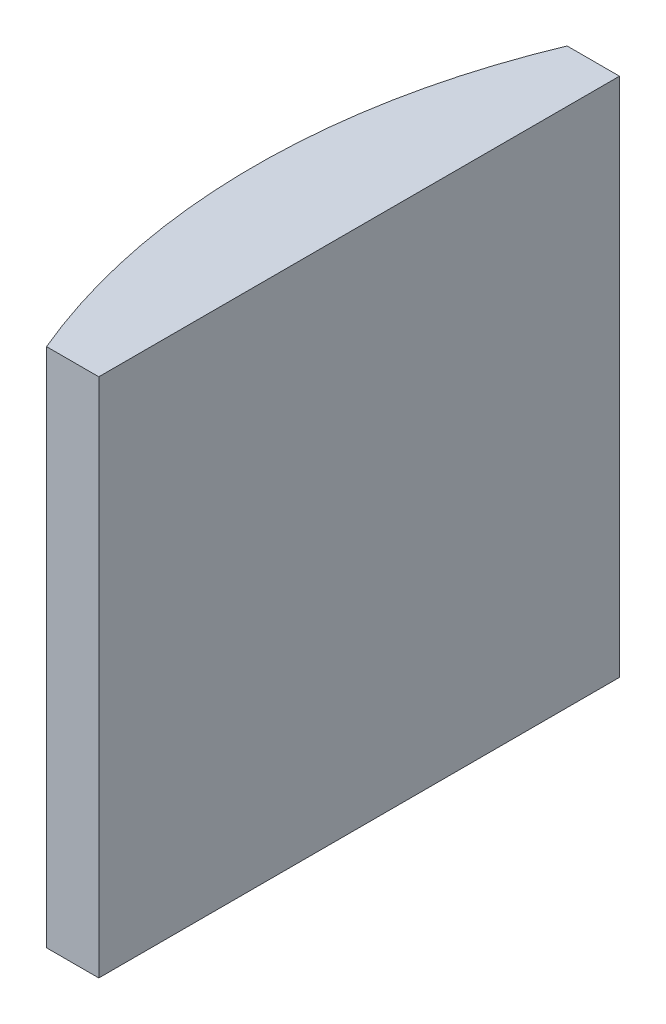
ISO-10303-21;
HEADER;
FILE_DESCRIPTION(('STEP AP214'),'2;1');
FILE_NAME('part.step','',(''),(''),'','','');
FILE_SCHEMA(('AUTOMOTIVE_DESIGN { 1 0 10303 214 1 1 1 1 }'));
ENDSEC;
DATA;
#1=APPLICATION_CONTEXT('core data for automotive mechanical design processes');
#2=APPLICATION_PROTOCOL_DEFINITION('international standard','automotive_design',2000,#1);
#3=PRODUCT_CONTEXT('',#1,'mechanical');
#4=PRODUCT('Part','Part','',(#3));
#5=PRODUCT_RELATED_PRODUCT_CATEGORY('part','',(#4));
#6=PRODUCT_DEFINITION_FORMATION('','',#4);
#7=PRODUCT_DEFINITION_CONTEXT('part definition',#1,'design');
#8=PRODUCT_DEFINITION('design','',#6,#7);
#9=PRODUCT_DEFINITION_SHAPE('','',#8);
#10=(LENGTH_UNIT() NAMED_UNIT(*) SI_UNIT(.MILLI.,.METRE.));
#11=(NAMED_UNIT(*) PLANE_ANGLE_UNIT() SI_UNIT($,.RADIAN.));
#12=(NAMED_UNIT(*) SI_UNIT($,.STERADIAN.) SOLID_ANGLE_UNIT());
#13=UNCERTAINTY_MEASURE_WITH_UNIT(LENGTH_MEASURE(1.E-05),#10,'distance_accuracy_value','');
#14=(GEOMETRIC_REPRESENTATION_CONTEXT(3) GLOBAL_UNCERTAINTY_ASSIGNED_CONTEXT((#13)) GLOBAL_UNIT_ASSIGNED_CONTEXT((#10,
#11,#12)) REPRESENTATION_CONTEXT('',''));
#15=CARTESIAN_POINT('',(0.,0.,0.));
#16=DIRECTION('',(0.,0.,1.));
#17=DIRECTION('',(1.,0.,0.));
#18=AXIS2_PLACEMENT_3D('',#15,#16,#17);
#19=CARTESIAN_POINT('',(4.35520433485127,20.,0.));
#20=DIRECTION('',(0.,-1.,0.));
#21=DIRECTION('',(0.,0.,-1.));
#22=AXIS2_PLACEMENT_3D('',#19,#20,#21);
#23=CYLINDRICAL_SURFACE('',#22,25.85);
#24=CARTESIAN_POINT('',(4.35520433485127,0.,0.));
#25=DIRECTION('',(0.,1.,0.));
#26=DIRECTION('',(0.,0.,1.));
#27=AXIS2_PLACEMENT_3D('',#24,#25,#26);
#28=CIRCLE('',#27,25.85);
#29=CARTESIAN_POINT('',(-19.4822137300315,0.,-10.));
#30=VERTEX_POINT('',#29);
#31=CARTESIAN_POINT('',(-19.4822137300315,0.,10.));
#32=VERTEX_POINT('',#31);
#33=EDGE_CURVE('E100',#30,#32,#28,.T.);
#34=ORIENTED_EDGE('',*,*,#33,.T.);
#35=DIRECTION('',(0.,-1.,0.));
#36=VECTOR('',#35,1.);
#37=CARTESIAN_POINT('',(-19.4822137300315,20.,10.));
#38=LINE('',#37,#36);
#39=CARTESIAN_POINT('',(-19.4822137300315,20.,10.));
#40=VERTEX_POINT('',#39);
#41=EDGE_CURVE('E11',#40,#32,#38,.T.);
#42=ORIENTED_EDGE('',*,*,#41,.F.);
#43=CARTESIAN_POINT('',(4.35520433485127,20.,0.));
#44=DIRECTION('',(0.,1.,0.));
#45=DIRECTION('',(0.,0.,1.));
#46=AXIS2_PLACEMENT_3D('',#43,#44,#45);
#47=CIRCLE('',#46,25.85);
#48=CARTESIAN_POINT('',(-19.4822137300315,20.,-10.));
#49=VERTEX_POINT('',#48);
#50=EDGE_CURVE('E88',#49,#40,#47,.T.);
#51=ORIENTED_EDGE('',*,*,#50,.F.);
#52=DIRECTION('',(0.,-1.,0.));
#53=VECTOR('',#52,1.);
#54=CARTESIAN_POINT('',(-19.4822137300315,20.,-10.));
#55=LINE('',#54,#53);
#56=EDGE_CURVE('E96',#49,#30,#55,.T.);
#57=ORIENTED_EDGE('',*,*,#56,.T.);
#58=EDGE_LOOP('',(#34,#42,#51,#57));
#59=FACE_BOUND('',#58,.T.);
#60=ADVANCED_FACE('F37',(#59),#23,.T.);
#61=CARTESIAN_POINT('',(-19.4822137300315,20.,10.));
#62=DIRECTION('',(0.,0.,-1.));
#63=DIRECTION('',(-1.,0.,0.));
#64=AXIS2_PLACEMENT_3D('',#61,#62,#63);
#65=PLANE('',#64);
#66=DIRECTION('',(1.,0.,0.));
#67=VECTOR('',#66,1.);
#68=CARTESIAN_POINT('',(-19.4822137300315,0.,10.));
#69=LINE('',#68,#67);
#70=CARTESIAN_POINT('',(-17.4747956651487,0.,10.));
#71=VERTEX_POINT('',#70);
#72=EDGE_CURVE('E92',#32,#71,#69,.T.);
#73=ORIENTED_EDGE('',*,*,#72,.T.);
#74=DIRECTION('',(0.,-1.,0.));
#75=VECTOR('',#74,1.);
#76=CARTESIAN_POINT('',(-17.4747956651487,20.,10.));
#77=LINE('',#76,#75);
#78=CARTESIAN_POINT('',(-17.4747956651487,20.,10.));
#79=VERTEX_POINT('',#78);
#80=EDGE_CURVE('E45',#79,#71,#77,.T.);
#81=ORIENTED_EDGE('',*,*,#80,.F.);
#82=DIRECTION('',(1.,0.,0.));
#83=VECTOR('',#82,1.);
#84=CARTESIAN_POINT('',(-19.4822137300315,20.,10.));
#85=LINE('',#84,#83);
#86=EDGE_CURVE('E83',#40,#79,#85,.T.);
#87=ORIENTED_EDGE('',*,*,#86,.F.);
#88=ORIENTED_EDGE('',*,*,#41,.T.);
#89=EDGE_LOOP('',(#73,#81,#87,#88));
#90=FACE_BOUND('',#89,.T.);
#91=ADVANCED_FACE('F91',(#90),#65,.F.);
#92=CARTESIAN_POINT('',(-17.4747956651487,20.,-10.));
#93=DIRECTION('',(-1.,0.,0.));
#94=DIRECTION('',(0.,0.,1.));
#95=AXIS2_PLACEMENT_3D('',#92,#93,#94);
#96=PLANE('',#95);
#97=DIRECTION('',(0.,0.,-1.));
#98=VECTOR('',#97,1.);
#99=CARTESIAN_POINT('',(-17.4747956651487,0.,-10.));
#100=LINE('',#99,#98);
#101=CARTESIAN_POINT('',(-17.4747956651487,0.,-10.));
#102=VERTEX_POINT('',#101);
#103=EDGE_CURVE('E70',#71,#102,#100,.T.);
#104=ORIENTED_EDGE('',*,*,#103,.T.);
#105=DIRECTION('',(0.,-1.,0.));
#106=VECTOR('',#105,1.);
#107=CARTESIAN_POINT('',(-17.4747956651487,20.,-10.));
#108=LINE('',#107,#106);
#109=CARTESIAN_POINT('',(-17.4747956651487,20.,-10.));
#110=VERTEX_POINT('',#109);
#111=EDGE_CURVE('E93',#110,#102,#108,.T.);
#112=ORIENTED_EDGE('',*,*,#111,.F.);
#113=DIRECTION('',(0.,0.,-1.));
#114=VECTOR('',#113,1.);
#115=CARTESIAN_POINT('',(-17.4747956651487,20.,-10.));
#116=LINE('',#115,#114);
#117=EDGE_CURVE('E86',#79,#110,#116,.T.);
#118=ORIENTED_EDGE('',*,*,#117,.F.);
#119=ORIENTED_EDGE('',*,*,#80,.T.);
#120=EDGE_LOOP('',(#104,#112,#118,#119));
#121=FACE_BOUND('',#120,.T.);
#122=ADVANCED_FACE('F94',(#121),#96,.F.);
#123=CARTESIAN_POINT('',(-19.4822137300315,20.,-10.));
#124=DIRECTION('',(0.,0.,1.));
#125=DIRECTION('',(1.,0.,0.));
#126=AXIS2_PLACEMENT_3D('',#123,#124,#125);
#127=PLANE('',#126);
#128=DIRECTION('',(-1.,0.,0.));
#129=VECTOR('',#128,1.);
#130=CARTESIAN_POINT('',(-19.4822137300315,0.,-10.));
#131=LINE('',#130,#129);
#132=EDGE_CURVE('E76',#102,#30,#131,.T.);
#133=ORIENTED_EDGE('',*,*,#132,.T.);
#134=ORIENTED_EDGE('',*,*,#56,.F.);
#135=DIRECTION('',(-1.,0.,0.));
#136=VECTOR('',#135,1.);
#137=CARTESIAN_POINT('',(-19.4822137300315,20.,-10.));
#138=LINE('',#137,#136);
#139=EDGE_CURVE('E53',#110,#49,#138,.T.);
#140=ORIENTED_EDGE('',*,*,#139,.F.);
#141=ORIENTED_EDGE('',*,*,#111,.T.);
#142=EDGE_LOOP('',(#133,#134,#140,#141));
#143=FACE_BOUND('',#142,.T.);
#144=ADVANCED_FACE('F107',(#143),#127,.F.);
#145=CARTESIAN_POINT('',(4.35520433485127,20.,0.));
#146=DIRECTION('',(0.,1.,0.));
#147=DIRECTION('',(0.,0.,1.));
#148=AXIS2_PLACEMENT_3D('',#145,#146,#147);
#149=PLANE('',#148);
#150=ORIENTED_EDGE('',*,*,#50,.T.);
#151=ORIENTED_EDGE('',*,*,#86,.T.);
#152=ORIENTED_EDGE('',*,*,#117,.T.);
#153=ORIENTED_EDGE('',*,*,#139,.T.);
#154=EDGE_LOOP('',(#150,#151,#152,#153));
#155=FACE_BOUND('',#154,.T.);
#156=ADVANCED_FACE('F84',(#155),#149,.T.);
#157=CARTESIAN_POINT('',(4.35520433485127,0.,0.));
#158=DIRECTION('',(0.,1.,0.));
#159=DIRECTION('',(0.,0.,1.));
#160=AXIS2_PLACEMENT_3D('',#157,#158,#159);
#161=PLANE('',#160);
#162=ORIENTED_EDGE('',*,*,#33,.F.);
#163=ORIENTED_EDGE('',*,*,#132,.F.);
#164=ORIENTED_EDGE('',*,*,#103,.F.);
#165=ORIENTED_EDGE('',*,*,#72,.F.);
#166=EDGE_LOOP('',(#162,#163,#164,#165));
#167=FACE_BOUND('',#166,.T.);
#168=ADVANCED_FACE('F110',(#167),#161,.F.);
#169=CLOSED_SHELL('',(#60,#91,#122,#144,#156,#168));
#170=MANIFOLD_SOLID_BREP('B2',#169);
#171=ADVANCED_BREP_SHAPE_REPRESENTATION('',(#18,#170),#14);
#172=SHAPE_DEFINITION_REPRESENTATION(#9,#171);
ENDSEC;
END-ISO-10303-21;
